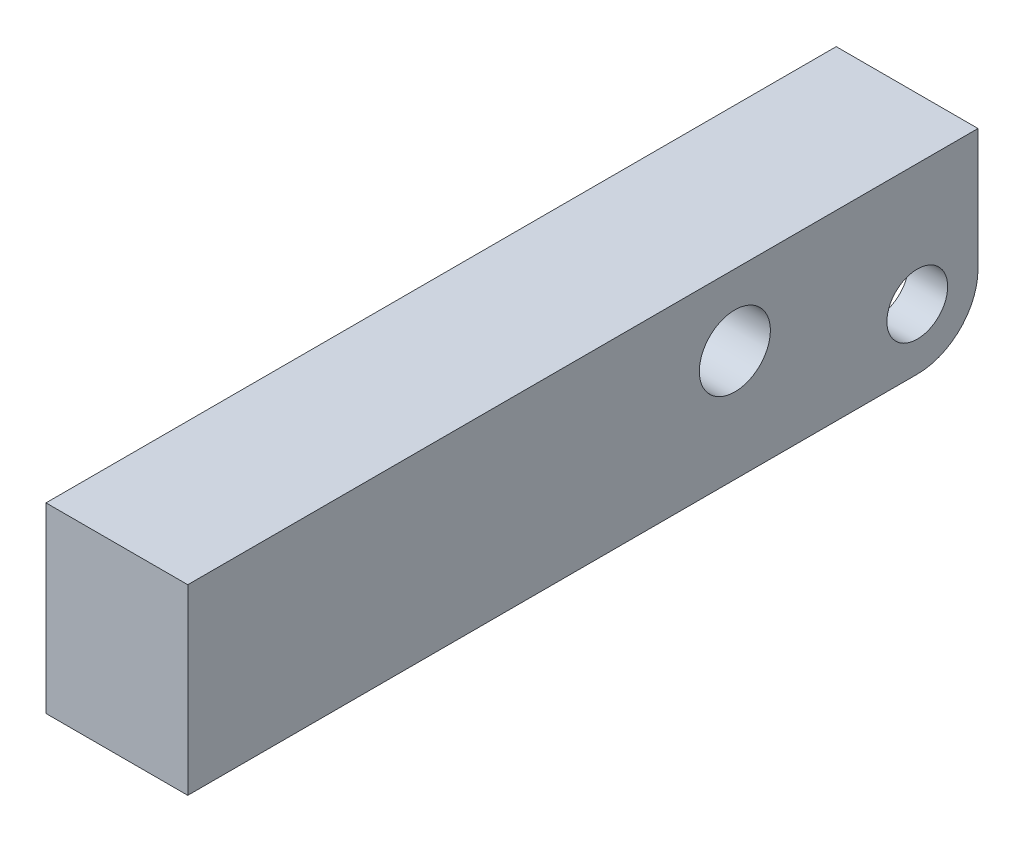
ISO-10303-21;
HEADER;
FILE_DESCRIPTION(('STEP AP214'),'2;1');
FILE_NAME('part.step','',(''),(''),'','','');
FILE_SCHEMA(('AUTOMOTIVE_DESIGN { 1 0 10303 214 1 1 1 1 }'));
ENDSEC;
DATA;
#1=APPLICATION_CONTEXT('core data for automotive mechanical design processes');
#2=APPLICATION_PROTOCOL_DEFINITION('international standard','automotive_design',2000,#1);
#3=PRODUCT_CONTEXT('',#1,'mechanical');
#4=PRODUCT('Part','Part','',(#3));
#5=PRODUCT_RELATED_PRODUCT_CATEGORY('part','',(#4));
#6=PRODUCT_DEFINITION_FORMATION('','',#4);
#7=PRODUCT_DEFINITION_CONTEXT('part definition',#1,'design');
#8=PRODUCT_DEFINITION('design','',#6,#7);
#9=PRODUCT_DEFINITION_SHAPE('','',#8);
#10=(LENGTH_UNIT() NAMED_UNIT(*) SI_UNIT(.MILLI.,.METRE.));
#11=(NAMED_UNIT(*) PLANE_ANGLE_UNIT() SI_UNIT($,.RADIAN.));
#12=(NAMED_UNIT(*) SI_UNIT($,.STERADIAN.) SOLID_ANGLE_UNIT());
#13=UNCERTAINTY_MEASURE_WITH_UNIT(LENGTH_MEASURE(1.E-05),#10,'distance_accuracy_value','');
#14=(GEOMETRIC_REPRESENTATION_CONTEXT(3) GLOBAL_UNCERTAINTY_ASSIGNED_CONTEXT((#13)) GLOBAL_UNIT_ASSIGNED_CONTEXT((#10,
#11,#12)) REPRESENTATION_CONTEXT('',''));
#15=CARTESIAN_POINT('',(0.,0.,0.));
#16=DIRECTION('',(0.,0.,1.));
#17=DIRECTION('',(1.,0.,0.));
#18=AXIS2_PLACEMENT_3D('',#15,#16,#17);
#19=CARTESIAN_POINT('',(-50.,5.99439999999999,5.9944));
#20=DIRECTION('',(1.,0.,0.));
#21=DIRECTION('',(0.,0.,-1.));
#22=AXIS2_PLACEMENT_3D('',#19,#20,#21);
#23=CYLINDRICAL_SURFACE('',#22,2.9972);
#24=CARTESIAN_POINT('',(-3.1496,5.99439999999999,5.9944));
#25=DIRECTION('',(-1.,0.,0.));
#26=DIRECTION('',(0.,0.,1.));
#27=AXIS2_PLACEMENT_3D('',#24,#25,#26);
#28=CIRCLE('',#27,2.9972);
#29=CARTESIAN_POINT('',(-3.1496,5.99439999999999,8.9916));
#30=VERTEX_POINT('',#29);
#31=EDGE_CURVE('E198',#30,#30,#28,.F.);
#32=ORIENTED_EDGE('',*,*,#31,.T.);
#33=EDGE_LOOP('',(#32));
#34=FACE_BOUND('',#33,.T.);
#35=CARTESIAN_POINT('',(-6.9977,5.99439999999999,5.9944));
#36=DIRECTION('',(-1.,0.,0.));
#37=DIRECTION('',(0.,0.,1.));
#38=AXIS2_PLACEMENT_3D('',#35,#36,#37);
#39=CIRCLE('',#38,2.9972);
#40=CARTESIAN_POINT('',(-6.9977,5.99439999999999,8.9916));
#41=VERTEX_POINT('',#40);
#42=EDGE_CURVE('E161',#41,#41,#39,.T.);
#43=ORIENTED_EDGE('',*,*,#42,.T.);
#44=EDGE_LOOP('',(#43));
#45=FACE_BOUND('',#44,.T.);
#46=ADVANCED_FACE('F32',(#34,#45),#23,.F.);
#47=CARTESIAN_POINT('',(-6.9977,18.0086,0.));
#48=DIRECTION('',(0.,0.,-1.));
#49=DIRECTION('',(0.,1.,0.));
#50=AXIS2_PLACEMENT_3D('',#47,#48,#49);
#51=PLANE('',#50);
#52=DIRECTION('',(0.,1.,0.));
#53=VECTOR('',#52,1.);
#54=CARTESIAN_POINT('',(6.9977,18.0086,0.));
#55=LINE('',#54,#53);
#56=CARTESIAN_POINT('',(6.9977,5.9944,0.));
#57=VERTEX_POINT('',#56);
#58=CARTESIAN_POINT('',(6.9977,18.0086,0.));
#59=VERTEX_POINT('',#58);
#60=EDGE_CURVE('E164',#57,#59,#55,.T.);
#61=ORIENTED_EDGE('',*,*,#60,.F.);
#62=DIRECTION('',(1.,0.,0.));
#63=VECTOR('',#62,1.);
#64=CARTESIAN_POINT('',(-6.9977,5.9944,0.));
#65=LINE('',#64,#63);
#66=CARTESIAN_POINT('',(3.1496,5.9944,0.));
#67=VERTEX_POINT('',#66);
#68=EDGE_CURVE('E211',#57,#67,#65,.F.);
#69=ORIENTED_EDGE('',*,*,#68,.T.);
#70=DIRECTION('',(0.,-1.,0.));
#71=VECTOR('',#70,1.);
#72=CARTESIAN_POINT('',(3.1496,13.208,0.));
#73=LINE('',#72,#71);
#74=CARTESIAN_POINT('',(3.1496,13.208,0.));
#75=VERTEX_POINT('',#74);
#76=EDGE_CURVE('E131',#75,#67,#73,.T.);
#77=ORIENTED_EDGE('',*,*,#76,.F.);
#78=DIRECTION('',(1.,0.,0.));
#79=VECTOR('',#78,1.);
#80=CARTESIAN_POINT('',(-3.1496,13.208,0.));
#81=LINE('',#80,#79);
#82=CARTESIAN_POINT('',(-3.1496,13.208,0.));
#83=VERTEX_POINT('',#82);
#84=EDGE_CURVE('E138',#83,#75,#81,.T.);
#85=ORIENTED_EDGE('',*,*,#84,.F.);
#86=DIRECTION('',(0.,-1.,0.));
#87=VECTOR('',#86,1.);
#88=CARTESIAN_POINT('',(-3.1496,13.208,0.));
#89=LINE('',#88,#87);
#90=CARTESIAN_POINT('',(-3.1496,5.9944,0.));
#91=VERTEX_POINT('',#90);
#92=EDGE_CURVE('E121',#83,#91,#89,.T.);
#93=ORIENTED_EDGE('',*,*,#92,.T.);
#94=DIRECTION('',(1.,0.,0.));
#95=VECTOR('',#94,1.);
#96=CARTESIAN_POINT('',(-6.9977,5.9944,0.));
#97=LINE('',#96,#95);
#98=CARTESIAN_POINT('',(-6.9977,5.9944,0.));
#99=VERTEX_POINT('',#98);
#100=EDGE_CURVE('E209',#91,#99,#97,.F.);
#101=ORIENTED_EDGE('',*,*,#100,.T.);
#102=DIRECTION('',(0.,1.,0.));
#103=VECTOR('',#102,1.);
#104=CARTESIAN_POINT('',(-6.9977,18.0086,0.));
#105=LINE('',#104,#103);
#106=CARTESIAN_POINT('',(-6.9977,18.0086,0.));
#107=VERTEX_POINT('',#106);
#108=EDGE_CURVE('E175',#99,#107,#105,.T.);
#109=ORIENTED_EDGE('',*,*,#108,.T.);
#110=DIRECTION('',(1.,0.,0.));
#111=VECTOR('',#110,1.);
#112=CARTESIAN_POINT('',(-6.9977,18.0086,0.));
#113=LINE('',#112,#111);
#114=EDGE_CURVE('E186',#107,#59,#113,.T.);
#115=ORIENTED_EDGE('',*,*,#114,.T.);
#116=EDGE_LOOP('',(#61,#69,#77,#85,#93,#101,#109,#115));
#117=FACE_BOUND('',#116,.T.);
#118=ADVANCED_FACE('F143',(#117),#51,.T.);
#119=CARTESIAN_POINT('',(-6.9977,0.,0.));
#120=DIRECTION('',(0.,-1.,0.));
#121=DIRECTION('',(0.,0.,-1.));
#122=AXIS2_PLACEMENT_3D('',#119,#120,#121);
#123=PLANE('',#122);
#124=CARTESIAN_POINT('',(0.,0.,13.208));
#125=DIRECTION('',(0.,-1.,0.));
#126=DIRECTION('',(0.,0.,-1.));
#127=AXIS2_PLACEMENT_3D('',#124,#125,#126);
#128=CIRCLE('',#127,3.9116);
#129=CARTESIAN_POINT('',(-3.9116,0.,13.208));
#130=VERTEX_POINT('',#129);
#131=CARTESIAN_POINT('',(3.9116,0.,13.208));
#132=VERTEX_POINT('',#131);
#133=EDGE_CURVE('E224',#130,#132,#128,.F.);
#134=ORIENTED_EDGE('',*,*,#133,.T.);
#135=DIRECTION('',(0.,0.,-1.));
#136=VECTOR('',#135,1.);
#137=CARTESIAN_POINT('',(3.9116,0.,5.9944));
#138=LINE('',#137,#136);
#139=CARTESIAN_POINT('',(3.9116,0.,5.9944));
#140=VERTEX_POINT('',#139);
#141=EDGE_CURVE('E226',#132,#140,#138,.T.);
#142=ORIENTED_EDGE('',*,*,#141,.T.);
#143=DIRECTION('',(1.,0.,0.));
#144=VECTOR('',#143,1.);
#145=CARTESIAN_POINT('',(-6.9977,0.,5.9944));
#146=LINE('',#145,#144);
#147=CARTESIAN_POINT('',(6.9977,0.,5.9944));
#148=VERTEX_POINT('',#147);
#149=EDGE_CURVE('E205',#140,#148,#146,.T.);
#150=ORIENTED_EDGE('',*,*,#149,.T.);
#151=DIRECTION('',(0.,0.,-1.));
#152=VECTOR('',#151,1.);
#153=CARTESIAN_POINT('',(6.9977,0.,0.));
#154=LINE('',#153,#152);
#155=CARTESIAN_POINT('',(6.9977,0.,78.0034));
#156=VERTEX_POINT('',#155);
#157=EDGE_CURVE('E172',#156,#148,#154,.T.);
#158=ORIENTED_EDGE('',*,*,#157,.F.);
#159=DIRECTION('',(1.,0.,0.));
#160=VECTOR('',#159,1.);
#161=CARTESIAN_POINT('',(-6.9977,0.,78.0034));
#162=LINE('',#161,#160);
#163=CARTESIAN_POINT('',(-6.9977,0.,78.0034));
#164=VERTEX_POINT('',#163);
#165=EDGE_CURVE('E187',#164,#156,#162,.T.);
#166=ORIENTED_EDGE('',*,*,#165,.F.);
#167=DIRECTION('',(0.,0.,-1.));
#168=VECTOR('',#167,1.);
#169=CARTESIAN_POINT('',(-6.9977,0.,0.));
#170=LINE('',#169,#168);
#171=CARTESIAN_POINT('',(-6.9977,0.,5.9944));
#172=VERTEX_POINT('',#171);
#173=EDGE_CURVE('E183',#164,#172,#170,.T.);
#174=ORIENTED_EDGE('',*,*,#173,.T.);
#175=DIRECTION('',(1.,0.,0.));
#176=VECTOR('',#175,1.);
#177=CARTESIAN_POINT('',(-6.9977,0.,5.9944));
#178=LINE('',#177,#176);
#179=CARTESIAN_POINT('',(-3.9116,0.,5.9944));
#180=VERTEX_POINT('',#179);
#181=EDGE_CURVE('E189',#172,#180,#178,.T.);
#182=ORIENTED_EDGE('',*,*,#181,.T.);
#183=DIRECTION('',(0.,0.,1.));
#184=VECTOR('',#183,1.);
#185=CARTESIAN_POINT('',(-3.9116,0.,13.208));
#186=LINE('',#185,#184);
#187=EDGE_CURVE('E222',#180,#130,#186,.T.);
#188=ORIENTED_EDGE('',*,*,#187,.T.);
#189=EDGE_LOOP('',(#134,#142,#150,#158,#166,#174,#182,#188));
#190=FACE_BOUND('',#189,.T.);
#191=ADVANCED_FACE('F249',(#190),#123,.T.);
#192=CARTESIAN_POINT('',(-6.9977,0.,78.0034));
#193=DIRECTION('',(0.,0.,1.));
#194=DIRECTION('',(1.,0.,0.));
#195=AXIS2_PLACEMENT_3D('',#192,#193,#194);
#196=PLANE('',#195);
#197=ORIENTED_EDGE('',*,*,#165,.T.);
#198=DIRECTION('',(0.,-1.,0.));
#199=VECTOR('',#198,1.);
#200=CARTESIAN_POINT('',(6.9977,0.,78.0034));
#201=LINE('',#200,#199);
#202=CARTESIAN_POINT('',(6.9977,18.0086,78.0034));
#203=VERTEX_POINT('',#202);
#204=EDGE_CURVE('E169',#203,#156,#201,.T.);
#205=ORIENTED_EDGE('',*,*,#204,.F.);
#206=DIRECTION('',(1.,0.,0.));
#207=VECTOR('',#206,1.);
#208=CARTESIAN_POINT('',(-6.9977,18.0086,78.0034));
#209=LINE('',#208,#207);
#210=CARTESIAN_POINT('',(-6.9977,18.0086,78.0034));
#211=VERTEX_POINT('',#210);
#212=EDGE_CURVE('E190',#211,#203,#209,.T.);
#213=ORIENTED_EDGE('',*,*,#212,.F.);
#214=DIRECTION('',(0.,-1.,0.));
#215=VECTOR('',#214,1.);
#216=CARTESIAN_POINT('',(-6.9977,0.,78.0034));
#217=LINE('',#216,#215);
#218=EDGE_CURVE('E180',#211,#164,#217,.T.);
#219=ORIENTED_EDGE('',*,*,#218,.T.);
#220=EDGE_LOOP('',(#197,#205,#213,#219));
#221=FACE_BOUND('',#220,.T.);
#222=ADVANCED_FACE('F265',(#221),#196,.T.);
#223=CARTESIAN_POINT('',(-6.9977,18.0086,78.0034));
#224=DIRECTION('',(0.,1.,0.));
#225=DIRECTION('',(0.,0.,1.));
#226=AXIS2_PLACEMENT_3D('',#223,#224,#225);
#227=PLANE('',#226);
#228=ORIENTED_EDGE('',*,*,#212,.T.);
#229=DIRECTION('',(0.,0.,1.));
#230=VECTOR('',#229,1.);
#231=CARTESIAN_POINT('',(6.9977,18.0086,78.0034));
#232=LINE('',#231,#230);
#233=EDGE_CURVE('E166',#59,#203,#232,.T.);
#234=ORIENTED_EDGE('',*,*,#233,.F.);
#235=ORIENTED_EDGE('',*,*,#114,.F.);
#236=DIRECTION('',(0.,0.,1.));
#237=VECTOR('',#236,1.);
#238=CARTESIAN_POINT('',(-6.9977,18.0086,78.0034));
#239=LINE('',#238,#237);
#240=EDGE_CURVE('E177',#107,#211,#239,.T.);
#241=ORIENTED_EDGE('',*,*,#240,.T.);
#242=EDGE_LOOP('',(#228,#234,#235,#241));
#243=FACE_BOUND('',#242,.T.);
#244=ADVANCED_FACE('F260',(#243),#227,.T.);
#245=CARTESIAN_POINT('',(-6.9977,0.,0.));
#246=DIRECTION('',(-1.,0.,0.));
#247=DIRECTION('',(0.,0.,1.));
#248=AXIS2_PLACEMENT_3D('',#245,#246,#247);
#249=PLANE('',#248);
#250=CARTESIAN_POINT('',(-6.9977,10.9982,24.003));
#251=DIRECTION('',(-1.,0.,0.));
#252=DIRECTION('',(0.,0.,1.));
#253=AXIS2_PLACEMENT_3D('',#250,#251,#252);
#254=CIRCLE('',#253,3.5052);
#255=CARTESIAN_POINT('',(-6.9977,10.9982,27.5082));
#256=VERTEX_POINT('',#255);
#257=EDGE_CURVE('E156',#256,#256,#254,.T.);
#258=ORIENTED_EDGE('',*,*,#257,.F.);
#259=EDGE_LOOP('',(#258));
#260=FACE_BOUND('',#259,.T.);
#261=ORIENTED_EDGE('',*,*,#42,.F.);
#262=EDGE_LOOP('',(#261));
#263=FACE_BOUND('',#262,.T.);
#264=ORIENTED_EDGE('',*,*,#108,.F.);
#265=CARTESIAN_POINT('',(-6.9977,5.9944,5.9944));
#266=DIRECTION('',(-1.,0.,0.));
#267=DIRECTION('',(0.,0.,1.));
#268=AXIS2_PLACEMENT_3D('',#265,#266,#267);
#269=CIRCLE('',#268,5.9944);
#270=EDGE_CURVE('E217',#99,#172,#269,.T.);
#271=ORIENTED_EDGE('',*,*,#270,.T.);
#272=ORIENTED_EDGE('',*,*,#173,.F.);
#273=ORIENTED_EDGE('',*,*,#218,.F.);
#274=ORIENTED_EDGE('',*,*,#240,.F.);
#275=EDGE_LOOP('',(#264,#271,#272,#273,#274));
#276=FACE_BOUND('',#275,.T.);
#277=ADVANCED_FACE('F255',(#260,#263,#276),#249,.T.);
#278=CARTESIAN_POINT('',(6.9977,0.,0.));
#279=DIRECTION('',(-1.,0.,0.));
#280=DIRECTION('',(0.,0.,1.));
#281=AXIS2_PLACEMENT_3D('',#278,#279,#280);
#282=PLANE('',#281);
#283=CARTESIAN_POINT('',(6.9977,10.9982,24.003));
#284=DIRECTION('',(-1.,0.,0.));
#285=DIRECTION('',(0.,0.,1.));
#286=AXIS2_PLACEMENT_3D('',#283,#284,#285);
#287=CIRCLE('',#286,3.5052);
#288=CARTESIAN_POINT('',(6.9977,10.9982,27.5082));
#289=VERTEX_POINT('',#288);
#290=EDGE_CURVE('E160',#289,#289,#287,.T.);
#291=ORIENTED_EDGE('',*,*,#290,.T.);
#292=EDGE_LOOP('',(#291));
#293=FACE_BOUND('',#292,.T.);
#294=CARTESIAN_POINT('',(6.9977,5.99439999999999,5.9944));
#295=DIRECTION('',(-1.,0.,0.));
#296=DIRECTION('',(0.,0.,1.));
#297=AXIS2_PLACEMENT_3D('',#294,#295,#296);
#298=CIRCLE('',#297,2.9972);
#299=CARTESIAN_POINT('',(6.9977,5.99439999999999,8.9916));
#300=VERTEX_POINT('',#299);
#301=EDGE_CURVE('E159',#300,#300,#298,.T.);
#302=ORIENTED_EDGE('',*,*,#301,.T.);
#303=EDGE_LOOP('',(#302));
#304=FACE_BOUND('',#303,.T.);
#305=ORIENTED_EDGE('',*,*,#157,.T.);
#306=CARTESIAN_POINT('',(6.9977,5.9944,5.9944));
#307=DIRECTION('',(-1.,0.,0.));
#308=DIRECTION('',(0.,0.,1.));
#309=AXIS2_PLACEMENT_3D('',#306,#307,#308);
#310=CIRCLE('',#309,5.9944);
#311=EDGE_CURVE('E207',#148,#57,#310,.F.);
#312=ORIENTED_EDGE('',*,*,#311,.T.);
#313=ORIENTED_EDGE('',*,*,#60,.T.);
#314=ORIENTED_EDGE('',*,*,#233,.T.);
#315=ORIENTED_EDGE('',*,*,#204,.T.);
#316=EDGE_LOOP('',(#305,#312,#313,#314,#315));
#317=FACE_BOUND('',#316,.T.);
#318=ADVANCED_FACE('F263',(#293,#304,#317),#282,.F.);
#319=CARTESIAN_POINT('',(3.1496,5.99439999999999,5.9944));
#320=DIRECTION('',(1.,0.,0.));
#321=DIRECTION('',(0.,0.,-1.));
#322=AXIS2_PLACEMENT_3D('',#319,#320,#321);
#323=CIRCLE('',#322,2.9972);
#324=CARTESIAN_POINT('',(3.1496,5.99439999999999,2.9972));
#325=VERTEX_POINT('',#324);
#326=EDGE_CURVE('E152',#325,#325,#323,.F.);
#327=ORIENTED_EDGE('',*,*,#326,.T.);
#328=EDGE_LOOP('',(#327));
#329=FACE_BOUND('',#328,.T.);
#330=ORIENTED_EDGE('',*,*,#301,.F.);
#331=EDGE_LOOP('',(#330));
#332=FACE_BOUND('',#331,.T.);
#333=ADVANCED_FACE('F277',(#329,#332),#23,.F.);
#334=CARTESIAN_POINT('',(-50.,10.9982,24.003));
#335=DIRECTION('',(1.,0.,0.));
#336=DIRECTION('',(0.,0.,-1.));
#337=AXIS2_PLACEMENT_3D('',#334,#335,#336);
#338=CYLINDRICAL_SURFACE('',#337,3.5052);
#339=ORIENTED_EDGE('',*,*,#257,.T.);
#340=EDGE_LOOP('',(#339));
#341=FACE_BOUND('',#340,.T.);
#342=ORIENTED_EDGE('',*,*,#290,.F.);
#343=EDGE_LOOP('',(#342));
#344=FACE_BOUND('',#343,.T.);
#345=ADVANCED_FACE('F286',(#341,#344),#338,.F.);
#346=CARTESIAN_POINT('',(-3.1496,13.208,13.208));
#347=DIRECTION('',(-1.,0.,0.));
#348=DIRECTION('',(0.,0.,1.));
#349=AXIS2_PLACEMENT_3D('',#346,#347,#348);
#350=PLANE('',#349);
#351=DIRECTION('',(0.,-1.,0.));
#352=VECTOR('',#351,1.);
#353=CARTESIAN_POINT('',(-3.1496,13.208,13.208));
#354=LINE('',#353,#352);
#355=CARTESIAN_POINT('',(-3.1496,13.208,13.208));
#356=VERTEX_POINT('',#355);
#357=CARTESIAN_POINT('',(-3.1496,0.762000000000001,13.208));
#358=VERTEX_POINT('',#357);
#359=EDGE_CURVE('E150',#356,#358,#354,.T.);
#360=ORIENTED_EDGE('',*,*,#359,.T.);
#361=DIRECTION('',(0.,0.,-1.));
#362=VECTOR('',#361,1.);
#363=CARTESIAN_POINT('',(-3.1496,0.761999999999998,5.9944));
#364=LINE('',#363,#362);
#365=CARTESIAN_POINT('',(-3.1496,0.761999999999999,3.06953733655749));
#366=VERTEX_POINT('',#365);
#367=EDGE_CURVE('E41',#358,#366,#364,.T.);
#368=ORIENTED_EDGE('',*,*,#367,.T.);
#369=CARTESIAN_POINT('',(-3.1496,5.9944,5.9944));
#370=DIRECTION('',(-1.,0.,0.));
#371=DIRECTION('',(0.,0.,1.));
#372=AXIS2_PLACEMENT_3D('',#369,#370,#371);
#373=CIRCLE('',#372,5.9944);
#374=EDGE_CURVE('E127',#366,#91,#373,.F.);
#375=ORIENTED_EDGE('',*,*,#374,.T.);
#376=ORIENTED_EDGE('',*,*,#92,.F.);
#377=DIRECTION('',(0.,0.,-1.));
#378=VECTOR('',#377,1.);
#379=CARTESIAN_POINT('',(-3.1496,13.208,13.208));
#380=LINE('',#379,#378);
#381=EDGE_CURVE('E125',#356,#83,#380,.T.);
#382=ORIENTED_EDGE('',*,*,#381,.F.);
#383=EDGE_LOOP('',(#360,#368,#375,#376,#382));
#384=FACE_BOUND('',#383,.T.);
#385=ORIENTED_EDGE('',*,*,#31,.F.);
#386=EDGE_LOOP('',(#385));
#387=FACE_BOUND('',#386,.T.);
#388=ADVANCED_FACE('F123',(#384,#387),#350,.F.);
#389=CARTESIAN_POINT('',(3.1496,13.208,13.208));
#390=DIRECTION('',(1.,0.,0.));
#391=DIRECTION('',(0.,0.,-1.));
#392=AXIS2_PLACEMENT_3D('',#389,#390,#391);
#393=PLANE('',#392);
#394=CARTESIAN_POINT('',(3.1496,5.9944,5.9944));
#395=DIRECTION('',(1.,0.,0.));
#396=DIRECTION('',(0.,0.,-1.));
#397=AXIS2_PLACEMENT_3D('',#394,#395,#396);
#398=CIRCLE('',#397,5.9944);
#399=CARTESIAN_POINT('',(3.1496,0.761999999999998,3.06953733655749));
#400=VERTEX_POINT('',#399);
#401=EDGE_CURVE('E213',#67,#400,#398,.F.);
#402=ORIENTED_EDGE('',*,*,#401,.T.);
#403=DIRECTION('',(0.,0.,1.));
#404=VECTOR('',#403,1.);
#405=CARTESIAN_POINT('',(3.1496,0.761999999999997,13.208));
#406=LINE('',#405,#404);
#407=CARTESIAN_POINT('',(3.1496,0.762000000000001,13.208));
#408=VERTEX_POINT('',#407);
#409=EDGE_CURVE('E219',#400,#408,#406,.T.);
#410=ORIENTED_EDGE('',*,*,#409,.T.);
#411=DIRECTION('',(0.,-1.,0.));
#412=VECTOR('',#411,1.);
#413=CARTESIAN_POINT('',(3.1496,13.208,13.208));
#414=LINE('',#413,#412);
#415=CARTESIAN_POINT('',(3.1496,13.208,13.208));
#416=VERTEX_POINT('',#415);
#417=EDGE_CURVE('E153',#416,#408,#414,.T.);
#418=ORIENTED_EDGE('',*,*,#417,.F.);
#419=DIRECTION('',(0.,0.,1.));
#420=VECTOR('',#419,1.);
#421=CARTESIAN_POINT('',(3.1496,13.208,13.208));
#422=LINE('',#421,#420);
#423=EDGE_CURVE('E145',#75,#416,#422,.T.);
#424=ORIENTED_EDGE('',*,*,#423,.F.);
#425=ORIENTED_EDGE('',*,*,#76,.T.);
#426=EDGE_LOOP('',(#402,#410,#418,#424,#425));
#427=FACE_BOUND('',#426,.T.);
#428=ORIENTED_EDGE('',*,*,#326,.F.);
#429=EDGE_LOOP('',(#428));
#430=FACE_BOUND('',#429,.T.);
#431=ADVANCED_FACE('F299',(#427,#430),#393,.F.);
#432=CARTESIAN_POINT('',(0.,13.208,13.208));
#433=DIRECTION('',(0.,-1.,0.));
#434=DIRECTION('',(0.,0.,-1.));
#435=AXIS2_PLACEMENT_3D('',#432,#433,#434);
#436=CYLINDRICAL_SURFACE('',#435,3.1496);
#437=ORIENTED_EDGE('',*,*,#417,.T.);
#438=CARTESIAN_POINT('',(0.,0.761999999999997,13.208));
#439=DIRECTION('',(0.,-1.,0.));
#440=DIRECTION('',(0.,0.,-1.));
#441=AXIS2_PLACEMENT_3D('',#438,#439,#440);
#442=CIRCLE('',#441,3.1496);
#443=EDGE_CURVE('E56',#408,#358,#442,.T.);
#444=ORIENTED_EDGE('',*,*,#443,.T.);
#445=ORIENTED_EDGE('',*,*,#359,.F.);
#446=CARTESIAN_POINT('',(0.,13.208,13.208));
#447=DIRECTION('',(0.,-1.,0.));
#448=DIRECTION('',(0.,0.,-1.));
#449=AXIS2_PLACEMENT_3D('',#446,#447,#448);
#450=CIRCLE('',#449,3.1496);
#451=EDGE_CURVE('E132',#416,#356,#450,.T.);
#452=ORIENTED_EDGE('',*,*,#451,.F.);
#453=EDGE_LOOP('',(#437,#444,#445,#452));
#454=FACE_BOUND('',#453,.T.);
#455=ADVANCED_FACE('F301',(#454),#436,.F.);
#456=CARTESIAN_POINT('',(0.,13.208,13.208));
#457=DIRECTION('',(0.,-1.,0.));
#458=DIRECTION('',(0.,0.,-1.));
#459=AXIS2_PLACEMENT_3D('',#456,#457,#458);
#460=PLANE('',#459);
#461=ORIENTED_EDGE('',*,*,#381,.T.);
#462=ORIENTED_EDGE('',*,*,#84,.T.);
#463=ORIENTED_EDGE('',*,*,#423,.T.);
#464=ORIENTED_EDGE('',*,*,#451,.T.);
#465=EDGE_LOOP('',(#461,#462,#463,#464));
#466=FACE_BOUND('',#465,.T.);
#467=ADVANCED_FACE('F136',(#466),#460,.T.);
#468=CARTESIAN_POINT('',(-6.9977,5.9944,5.9944));
#469=DIRECTION('',(1.,0.,0.));
#470=DIRECTION('',(0.,0.,-1.));
#471=AXIS2_PLACEMENT_3D('',#468,#469,#470);
#472=CYLINDRICAL_SURFACE('',#471,5.9944);
#473=ORIENTED_EDGE('',*,*,#149,.F.);
#474=CARTESIAN_POINT('',(-2.08280000000001,5.9944,5.9944));
#475=DIRECTION('',(-0.707106781186547,-0.707106781186548,0.));
#476=DIRECTION('',(0.707106781186548,-0.707106781186547,0.));
#477=AXIS2_PLACEMENT_3D('',#474,#475,#476);
#478=ELLIPSE('',#477,8.47736177828929,5.9944);
#479=EDGE_CURVE('E228',#140,#400,#478,.F.);
#480=ORIENTED_EDGE('',*,*,#479,.T.);
#481=ORIENTED_EDGE('',*,*,#401,.F.);
#482=ORIENTED_EDGE('',*,*,#68,.F.);
#483=ORIENTED_EDGE('',*,*,#311,.F.);
#484=EDGE_LOOP('',(#473,#480,#481,#482,#483));
#485=FACE_BOUND('',#484,.T.);
#486=ADVANCED_FACE('F312',(#485),#472,.T.);
#487=CARTESIAN_POINT('',(-6.9977,5.9944,5.9944));
#488=DIRECTION('',(1.,0.,0.));
#489=DIRECTION('',(0.,0.,-1.));
#490=AXIS2_PLACEMENT_3D('',#487,#488,#489);
#491=CYLINDRICAL_SURFACE('',#490,5.9944);
#492=ORIENTED_EDGE('',*,*,#374,.F.);
#493=CARTESIAN_POINT('',(2.0828,5.9944,5.9944));
#494=DIRECTION('',(0.707106781186547,-0.707106781186548,0.));
#495=DIRECTION('',(0.707106781186548,0.707106781186547,0.));
#496=AXIS2_PLACEMENT_3D('',#493,#494,#495);
#497=ELLIPSE('',#496,8.47736177828928,5.9944);
#498=EDGE_CURVE('E11',#366,#180,#497,.F.);
#499=ORIENTED_EDGE('',*,*,#498,.T.);
#500=ORIENTED_EDGE('',*,*,#181,.F.);
#501=ORIENTED_EDGE('',*,*,#270,.F.);
#502=ORIENTED_EDGE('',*,*,#100,.F.);
#503=EDGE_LOOP('',(#492,#499,#500,#501,#502));
#504=FACE_BOUND('',#503,.T.);
#505=ADVANCED_FACE('F246',(#504),#491,.T.);
#506=CARTESIAN_POINT('',(-3.1496,0.761999999999997,13.208));
#507=DIRECTION('',(0.707106781186547,-0.707106781186548,0.));
#508=DIRECTION('',(0.707106781186548,0.707106781186547,0.));
#509=AXIS2_PLACEMENT_3D('',#506,#507,#508);
#510=PLANE('',#509);
#511=ORIENTED_EDGE('',*,*,#498,.F.);
#512=ORIENTED_EDGE('',*,*,#367,.F.);
#513=DIRECTION('',(0.707106781186548,0.707106781186547,0.));
#514=VECTOR('',#513,1.);
#515=CARTESIAN_POINT('',(-3.9116,0.,13.208));
#516=LINE('',#515,#514);
#517=EDGE_CURVE('E36',#130,#358,#516,.T.);
#518=ORIENTED_EDGE('',*,*,#517,.F.);
#519=ORIENTED_EDGE('',*,*,#187,.F.);
#520=EDGE_LOOP('',(#511,#512,#518,#519));
#521=FACE_BOUND('',#520,.T.);
#522=ADVANCED_FACE('F34',(#521),#510,.T.);
#523=CARTESIAN_POINT('',(0.,0.761999999999997,13.208));
#524=DIRECTION('',(0.,-1.,0.));
#525=DIRECTION('',(0.,0.,-1.));
#526=AXIS2_PLACEMENT_3D('',#523,#524,#525);
#527=CONICAL_SURFACE('',#526,3.1496,0.785398163397448);
#528=ORIENTED_EDGE('',*,*,#517,.T.);
#529=ORIENTED_EDGE('',*,*,#443,.F.);
#530=DIRECTION('',(-0.707106781186548,0.707106781186547,0.));
#531=VECTOR('',#530,1.);
#532=CARTESIAN_POINT('',(3.9116,0.,13.208));
#533=LINE('',#532,#531);
#534=EDGE_CURVE('E231',#132,#408,#533,.T.);
#535=ORIENTED_EDGE('',*,*,#534,.F.);
#536=ORIENTED_EDGE('',*,*,#133,.F.);
#537=EDGE_LOOP('',(#528,#529,#535,#536));
#538=FACE_BOUND('',#537,.T.);
#539=ADVANCED_FACE('F240',(#538),#527,.F.);
#540=CARTESIAN_POINT('',(3.1496,0.761999999999997,13.208));
#541=DIRECTION('',(-0.707106781186547,-0.707106781186548,0.));
#542=DIRECTION('',(0.707106781186548,-0.707106781186547,0.));
#543=AXIS2_PLACEMENT_3D('',#540,#541,#542);
#544=PLANE('',#543);
#545=ORIENTED_EDGE('',*,*,#479,.F.);
#546=ORIENTED_EDGE('',*,*,#141,.F.);
#547=ORIENTED_EDGE('',*,*,#534,.T.);
#548=ORIENTED_EDGE('',*,*,#409,.F.);
#549=EDGE_LOOP('',(#545,#546,#547,#548));
#550=FACE_BOUND('',#549,.T.);
#551=ADVANCED_FACE('F324',(#550),#544,.T.);
#552=CLOSED_SHELL('',(#46,#118,#191,#222,#244,#277,#318,#333,#345,#388,#431,#455,#467,#486,#505,
#522,#539,#551));
#553=MANIFOLD_SOLID_BREP('B2',#552);
#554=ADVANCED_BREP_SHAPE_REPRESENTATION('',(#18,#553),#14);
#555=SHAPE_DEFINITION_REPRESENTATION(#9,#554);
ENDSEC;
END-ISO-10303-21;
